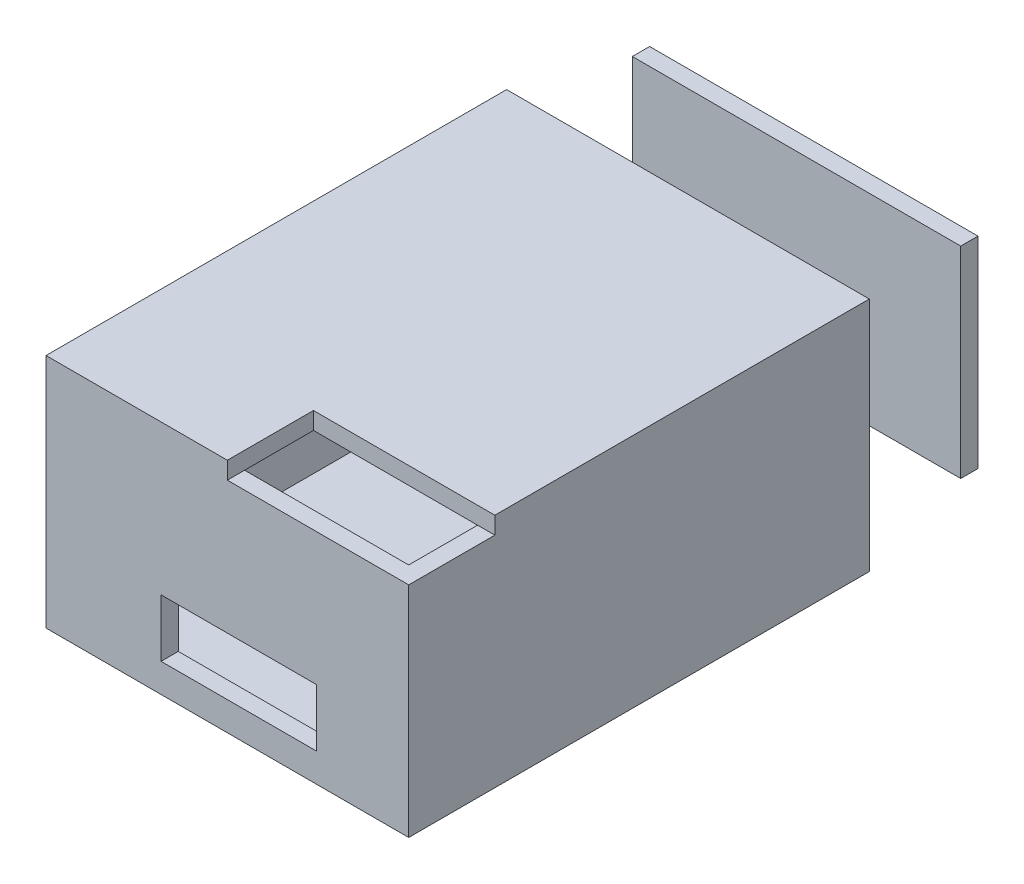
ISO-10303-21;
HEADER;
FILE_DESCRIPTION(('STEP AP214'),'2;1');
FILE_NAME('part.step','',(''),(''),'','','');
FILE_SCHEMA(('AUTOMOTIVE_DESIGN { 1 0 10303 214 1 1 1 1 }'));
ENDSEC;
DATA;
#1=APPLICATION_CONTEXT('core data for automotive mechanical design processes');
#2=APPLICATION_PROTOCOL_DEFINITION('international standard','automotive_design',2000,#1);
#3=PRODUCT_CONTEXT('',#1,'mechanical');
#4=PRODUCT('Part','Part','',(#3));
#5=PRODUCT_RELATED_PRODUCT_CATEGORY('part','',(#4));
#6=PRODUCT_DEFINITION_FORMATION('','',#4);
#7=PRODUCT_DEFINITION_CONTEXT('part definition',#1,'design');
#8=PRODUCT_DEFINITION('design','',#6,#7);
#9=PRODUCT_DEFINITION_SHAPE('','',#8);
#10=(LENGTH_UNIT() NAMED_UNIT(*) SI_UNIT(.MILLI.,.METRE.));
#11=(NAMED_UNIT(*) PLANE_ANGLE_UNIT() SI_UNIT($,.RADIAN.));
#12=(NAMED_UNIT(*) SI_UNIT($,.STERADIAN.) SOLID_ANGLE_UNIT());
#13=UNCERTAINTY_MEASURE_WITH_UNIT(LENGTH_MEASURE(1.E-05),#10,'distance_accuracy_value','');
#14=(GEOMETRIC_REPRESENTATION_CONTEXT(3) GLOBAL_UNCERTAINTY_ASSIGNED_CONTEXT((#13)) GLOBAL_UNIT_ASSIGNED_CONTEXT((#10,
#11,#12)) REPRESENTATION_CONTEXT('',''));
#15=CARTESIAN_POINT('',(0.,0.,0.));
#16=DIRECTION('',(0.,0.,1.));
#17=DIRECTION('',(1.,0.,0.));
#18=AXIS2_PLACEMENT_3D('',#15,#16,#17);
#19=CARTESIAN_POINT('',(1.83640845354915,36.8983163967638,-23.));
#20=DIRECTION('',(0.,-1.,0.));
#21=DIRECTION('',(0.,0.,-1.));
#22=AXIS2_PLACEMENT_3D('',#19,#20,#21);
#23=PLANE('',#22);
#24=DIRECTION('',(1.,0.,0.));
#25=VECTOR('',#24,1.);
#26=CARTESIAN_POINT('',(1.83640845354915,36.8983163967638,-20.));
#27=LINE('',#26,#25);
#28=CARTESIAN_POINT('',(1.83640845354915,36.8983163967638,-20.));
#29=VERTEX_POINT('',#28);
#30=CARTESIAN_POINT('',(58.8750360024886,36.8983163967638,-20.));
#31=VERTEX_POINT('',#30);
#32=EDGE_CURVE('E111',#29,#31,#27,.T.);
#33=ORIENTED_EDGE('',*,*,#32,.T.);
#34=DIRECTION('',(0.,0.,1.));
#35=VECTOR('',#34,1.);
#36=CARTESIAN_POINT('',(58.8750360024886,36.8983163967638,-23.));
#37=LINE('',#36,#35);
#38=CARTESIAN_POINT('',(58.8750360024886,36.8983163967638,-23.));
#39=VERTEX_POINT('',#38);
#40=EDGE_CURVE('E12',#39,#31,#37,.T.);
#41=ORIENTED_EDGE('',*,*,#40,.F.);
#42=DIRECTION('',(1.,0.,0.));
#43=VECTOR('',#42,1.);
#44=CARTESIAN_POINT('',(1.83640845354915,36.8983163967638,-23.));
#45=LINE('',#44,#43);
#46=CARTESIAN_POINT('',(1.83640845354915,36.8983163967638,-23.));
#47=VERTEX_POINT('',#46);
#48=EDGE_CURVE('E99',#47,#39,#45,.T.);
#49=ORIENTED_EDGE('',*,*,#48,.F.);
#50=DIRECTION('',(0.,0.,1.));
#51=VECTOR('',#50,1.);
#52=CARTESIAN_POINT('',(1.83640845354915,36.8983163967638,-23.));
#53=LINE('',#52,#51);
#54=EDGE_CURVE('E107',#47,#29,#53,.T.);
#55=ORIENTED_EDGE('',*,*,#54,.T.);
#56=EDGE_LOOP('',(#33,#41,#49,#55));
#57=FACE_BOUND('',#56,.T.);
#58=ADVANCED_FACE('F48',(#57),#23,.F.);
#59=CARTESIAN_POINT('',(58.8750360024886,36.8983163967638,-23.));
#60=DIRECTION('',(-1.,0.,0.));
#61=DIRECTION('',(0.,0.,1.));
#62=AXIS2_PLACEMENT_3D('',#59,#60,#61);
#63=PLANE('',#62);
#64=DIRECTION('',(0.,-1.,0.));
#65=VECTOR('',#64,1.);
#66=CARTESIAN_POINT('',(58.8750360024886,36.8983163967638,-20.));
#67=LINE('',#66,#65);
#68=CARTESIAN_POINT('',(58.8750360024886,1.9307687903769,-20.));
#69=VERTEX_POINT('',#68);
#70=EDGE_CURVE('E103',#31,#69,#67,.T.);
#71=ORIENTED_EDGE('',*,*,#70,.T.);
#72=DIRECTION('',(0.,0.,1.));
#73=VECTOR('',#72,1.);
#74=CARTESIAN_POINT('',(58.8750360024886,1.9307687903769,-23.));
#75=LINE('',#74,#73);
#76=CARTESIAN_POINT('',(58.8750360024886,1.9307687903769,-23.));
#77=VERTEX_POINT('',#76);
#78=EDGE_CURVE('E56',#77,#69,#75,.T.);
#79=ORIENTED_EDGE('',*,*,#78,.F.);
#80=DIRECTION('',(0.,-1.,0.));
#81=VECTOR('',#80,1.);
#82=CARTESIAN_POINT('',(58.8750360024886,36.8983163967638,-23.));
#83=LINE('',#82,#81);
#84=EDGE_CURVE('E94',#39,#77,#83,.T.);
#85=ORIENTED_EDGE('',*,*,#84,.F.);
#86=ORIENTED_EDGE('',*,*,#40,.T.);
#87=EDGE_LOOP('',(#71,#79,#85,#86));
#88=FACE_BOUND('',#87,.T.);
#89=ADVANCED_FACE('F102',(#88),#63,.F.);
#90=CARTESIAN_POINT('',(58.8750360024886,1.9307687903769,-23.));
#91=DIRECTION('',(0.,1.,0.));
#92=DIRECTION('',(0.,0.,1.));
#93=AXIS2_PLACEMENT_3D('',#90,#91,#92);
#94=PLANE('',#93);
#95=DIRECTION('',(-1.,0.,0.));
#96=VECTOR('',#95,1.);
#97=CARTESIAN_POINT('',(58.8750360024886,1.9307687903769,-20.));
#98=LINE('',#97,#96);
#99=CARTESIAN_POINT('',(1.83640845354915,1.9307687903769,-20.));
#100=VERTEX_POINT('',#99);
#101=EDGE_CURVE('E81',#69,#100,#98,.T.);
#102=ORIENTED_EDGE('',*,*,#101,.T.);
#103=DIRECTION('',(0.,0.,1.));
#104=VECTOR('',#103,1.);
#105=CARTESIAN_POINT('',(1.83640845354915,1.9307687903769,-23.));
#106=LINE('',#105,#104);
#107=CARTESIAN_POINT('',(1.83640845354915,1.9307687903769,-23.));
#108=VERTEX_POINT('',#107);
#109=EDGE_CURVE('E104',#108,#100,#106,.T.);
#110=ORIENTED_EDGE('',*,*,#109,.F.);
#111=DIRECTION('',(-1.,0.,0.));
#112=VECTOR('',#111,1.);
#113=CARTESIAN_POINT('',(58.8750360024886,1.9307687903769,-23.));
#114=LINE('',#113,#112);
#115=EDGE_CURVE('E97',#77,#108,#114,.T.);
#116=ORIENTED_EDGE('',*,*,#115,.F.);
#117=ORIENTED_EDGE('',*,*,#78,.T.);
#118=EDGE_LOOP('',(#102,#110,#116,#117));
#119=FACE_BOUND('',#118,.T.);
#120=ADVANCED_FACE('F105',(#119),#94,.F.);
#121=CARTESIAN_POINT('',(1.83640845354915,1.9307687903769,-23.));
#122=DIRECTION('',(1.,0.,0.));
#123=DIRECTION('',(0.,0.,-1.));
#124=AXIS2_PLACEMENT_3D('',#121,#122,#123);
#125=PLANE('',#124);
#126=DIRECTION('',(0.,1.,0.));
#127=VECTOR('',#126,1.);
#128=CARTESIAN_POINT('',(1.83640845354915,1.9307687903769,-20.));
#129=LINE('',#128,#127);
#130=EDGE_CURVE('E87',#100,#29,#129,.T.);
#131=ORIENTED_EDGE('',*,*,#130,.T.);
#132=ORIENTED_EDGE('',*,*,#54,.F.);
#133=DIRECTION('',(0.,1.,0.));
#134=VECTOR('',#133,1.);
#135=CARTESIAN_POINT('',(1.83640845354915,1.9307687903769,-23.));
#136=LINE('',#135,#134);
#137=EDGE_CURVE('E64',#108,#47,#136,.T.);
#138=ORIENTED_EDGE('',*,*,#137,.F.);
#139=ORIENTED_EDGE('',*,*,#109,.T.);
#140=EDGE_LOOP('',(#131,#132,#138,#139));
#141=FACE_BOUND('',#140,.T.);
#142=ADVANCED_FACE('F118',(#141),#125,.F.);
#143=CARTESIAN_POINT('',(0.,0.,-23.));
#144=DIRECTION('',(0.,0.,-1.));
#145=DIRECTION('',(-1.,0.,0.));
#146=AXIS2_PLACEMENT_3D('',#143,#144,#145);
#147=PLANE('',#146);
#148=ORIENTED_EDGE('',*,*,#48,.T.);
#149=ORIENTED_EDGE('',*,*,#84,.T.);
#150=ORIENTED_EDGE('',*,*,#115,.T.);
#151=ORIENTED_EDGE('',*,*,#137,.T.);
#152=EDGE_LOOP('',(#148,#149,#150,#151));
#153=FACE_BOUND('',#152,.T.);
#154=ADVANCED_FACE('F95',(#153),#147,.T.);
#155=CARTESIAN_POINT('',(0.,0.,-20.));
#156=DIRECTION('',(0.,0.,-1.));
#157=DIRECTION('',(-1.,0.,0.));
#158=AXIS2_PLACEMENT_3D('',#155,#156,#157);
#159=PLANE('',#158);
#160=ORIENTED_EDGE('',*,*,#32,.F.);
#161=ORIENTED_EDGE('',*,*,#130,.F.);
#162=ORIENTED_EDGE('',*,*,#101,.F.);
#163=ORIENTED_EDGE('',*,*,#70,.F.);
#164=EDGE_LOOP('',(#160,#161,#162,#163));
#165=FACE_BOUND('',#164,.T.);
#166=ADVANCED_FACE('F121',(#165),#159,.F.);
#167=CLOSED_SHELL('',(#58,#89,#120,#142,#154,#166));
#168=MANIFOLD_SOLID_BREP('B2',#167);
#169=CARTESIAN_POINT('',(0.,38.,0.));
#170=DIRECTION('',(0.,1.,0.));
#171=DIRECTION('',(0.,0.,1.));
#172=AXIS2_PLACEMENT_3D('',#169,#170,#171);
#173=PLANE('',#172);
#174=DIRECTION('',(-1.,0.,0.));
#175=VECTOR('',#174,1.);
#176=CARTESIAN_POINT('',(60.0017062927378,38.,77.0105584615521));
#177=LINE('',#176,#175);
#178=CARTESIAN_POINT('',(60.0017062927378,38.,77.0105584615521));
#179=VERTEX_POINT('',#178);
#180=CARTESIAN_POINT('',(31.4992071128971,38.,77.0105584615521));
#181=VERTEX_POINT('',#180);
#182=EDGE_CURVE('E384',#179,#181,#177,.T.);
#183=ORIENTED_EDGE('',*,*,#182,.T.);
#184=DIRECTION('',(-0.000265229162297402,0.,-0.999999964826745));
#185=VECTOR('',#184,1.);
#186=CARTESIAN_POINT('',(31.5,38.,80.));
#187=LINE('',#186,#185);
#188=CARTESIAN_POINT('',(31.5,38.,80.));
#189=VERTEX_POINT('',#188);
#190=EDGE_CURVE('E325',#189,#181,#187,.T.);
#191=ORIENTED_EDGE('',*,*,#190,.F.);
#192=DIRECTION('',(1.,0.,0.));
#193=VECTOR('',#192,1.);
#194=CARTESIAN_POINT('',(0.,38.,80.));
#195=LINE('',#194,#193);
#196=CARTESIAN_POINT('',(63.,38.,80.));
#197=VERTEX_POINT('',#196);
#198=EDGE_CURVE('E372',#189,#197,#195,.T.);
#199=ORIENTED_EDGE('',*,*,#198,.T.);
#200=DIRECTION('',(0.,0.,-1.));
#201=VECTOR('',#200,1.);
#202=CARTESIAN_POINT('',(63.,38.,80.));
#203=LINE('',#202,#201);
#204=CARTESIAN_POINT('',(63.,38.,65.0418472472438));
#205=VERTEX_POINT('',#204);
#206=EDGE_CURVE('E375',#197,#205,#203,.T.);
#207=ORIENTED_EDGE('',*,*,#206,.T.);
#208=DIRECTION('',(1.,0.,0.));
#209=VECTOR('',#208,1.);
#210=CARTESIAN_POINT('',(63.,38.,65.0418472472438));
#211=LINE('',#210,#209);
#212=CARTESIAN_POINT('',(60.0017062927378,38.,65.0418472472438));
#213=VERTEX_POINT('',#212);
#214=EDGE_CURVE('E367',#213,#205,#211,.T.);
#215=ORIENTED_EDGE('',*,*,#214,.F.);
#216=DIRECTION('',(0.,0.,1.));
#217=VECTOR('',#216,1.);
#218=CARTESIAN_POINT('',(60.0017062927378,38.,0.));
#219=LINE('',#218,#217);
#220=EDGE_CURVE('E379',#213,#179,#219,.T.);
#221=ORIENTED_EDGE('',*,*,#220,.T.);
#222=EDGE_LOOP('',(#183,#191,#199,#207,#215,#221));
#223=FACE_BOUND('',#222,.T.);
#224=ADVANCED_FACE('F171',(#223),#173,.T.);
#225=CARTESIAN_POINT('',(63.,41.,65.0418472472438));
#226=DIRECTION('',(0.,0.,-1.));
#227=DIRECTION('',(-1.,0.,0.));
#228=AXIS2_PLACEMENT_3D('',#225,#226,#227);
#229=PLANE('',#228);
#230=DIRECTION('',(0.,-1.,0.));
#231=VECTOR('',#230,1.);
#232=CARTESIAN_POINT('',(31.4960326615363,41.,65.0418472472438));
#233=LINE('',#232,#231);
#234=CARTESIAN_POINT('',(31.4960326615363,41.,65.0418472472438));
#235=VERTEX_POINT('',#234);
#236=CARTESIAN_POINT('',(31.4960326615363,38.,65.0418472472438));
#237=VERTEX_POINT('',#236);
#238=EDGE_CURVE('E329',#235,#237,#233,.T.);
#239=ORIENTED_EDGE('',*,*,#238,.T.);
#240=EDGE_CURVE('E350',#237,#213,#211,.T.);
#241=ORIENTED_EDGE('',*,*,#240,.T.);
#242=ORIENTED_EDGE('',*,*,#214,.T.);
#243=DIRECTION('',(0.,-1.,0.));
#244=VECTOR('',#243,1.);
#245=CARTESIAN_POINT('',(63.,41.,65.0418472472438));
#246=LINE('',#245,#244);
#247=CARTESIAN_POINT('',(63.,41.,65.0418472472438));
#248=VERTEX_POINT('',#247);
#249=EDGE_CURVE('E361',#248,#205,#246,.T.);
#250=ORIENTED_EDGE('',*,*,#249,.F.);
#251=DIRECTION('',(1.,0.,0.));
#252=VECTOR('',#251,1.);
#253=CARTESIAN_POINT('',(63.,41.,65.0418472472438));
#254=LINE('',#253,#252);
#255=EDGE_CURVE('E354',#235,#248,#254,.T.);
#256=ORIENTED_EDGE('',*,*,#255,.F.);
#257=EDGE_LOOP('',(#239,#241,#242,#250,#256));
#258=FACE_BOUND('',#257,.T.);
#259=ADVANCED_FACE('F475',(#258),#229,.F.);
#260=CARTESIAN_POINT('',(0.,3.,0.));
#261=DIRECTION('',(0.,-1.,0.));
#262=DIRECTION('',(0.,0.,-1.));
#263=AXIS2_PLACEMENT_3D('',#260,#261,#262);
#264=PLANE('',#263);
#265=DIRECTION('',(0.,0.,-1.));
#266=VECTOR('',#265,1.);
#267=CARTESIAN_POINT('',(2.99035903033484,3.,77.0105584615521));
#268=LINE('',#267,#266);
#269=CARTESIAN_POINT('',(2.99035903033484,3.,77.0105584615521));
#270=VERTEX_POINT('',#269);
#271=CARTESIAN_POINT('',(2.99035903033484,3.,0.));
#272=VERTEX_POINT('',#271);
#273=EDGE_CURVE('E376',#270,#272,#268,.T.);
#274=ORIENTED_EDGE('',*,*,#273,.F.);
#275=DIRECTION('',(-1.,0.,0.));
#276=VECTOR('',#275,1.);
#277=CARTESIAN_POINT('',(60.0017062927378,3.,77.0105584615521));
#278=LINE('',#277,#276);
#279=CARTESIAN_POINT('',(60.0017062927378,3.,77.0105584615521));
#280=VERTEX_POINT('',#279);
#281=EDGE_CURVE('E395',#280,#270,#278,.T.);
#282=ORIENTED_EDGE('',*,*,#281,.F.);
#283=DIRECTION('',(0.,0.,1.));
#284=VECTOR('',#283,1.);
#285=CARTESIAN_POINT('',(60.0017062927378,3.,0.));
#286=LINE('',#285,#284);
#287=CARTESIAN_POINT('',(60.0017062927378,3.,0.));
#288=VERTEX_POINT('',#287);
#289=EDGE_CURVE('E371',#288,#280,#286,.T.);
#290=ORIENTED_EDGE('',*,*,#289,.F.);
#291=DIRECTION('',(-1.,0.,0.));
#292=VECTOR('',#291,1.);
#293=CARTESIAN_POINT('',(0.,3.,0.));
#294=LINE('',#293,#292);
#295=EDGE_CURVE('E418',#288,#272,#294,.T.);
#296=ORIENTED_EDGE('',*,*,#295,.T.);
#297=EDGE_LOOP('',(#274,#282,#290,#296));
#298=FACE_BOUND('',#297,.T.);
#299=ADVANCED_FACE('F481',(#298),#264,.F.);
#300=CARTESIAN_POINT('',(0.,3.,80.));
#301=DIRECTION('',(1.,0.,0.));
#302=DIRECTION('',(0.,0.,-1.));
#303=AXIS2_PLACEMENT_3D('',#300,#301,#302);
#304=PLANE('',#303);
#305=DIRECTION('',(0.,-1.,0.));
#306=VECTOR('',#305,1.);
#307=CARTESIAN_POINT('',(0.,3.,80.));
#308=LINE('',#307,#306);
#309=CARTESIAN_POINT('',(0.,41.,80.));
#310=VERTEX_POINT('',#309);
#311=CARTESIAN_POINT('',(0.,0.,80.));
#312=VERTEX_POINT('',#311);
#313=EDGE_CURVE('E445',#310,#312,#308,.T.);
#314=ORIENTED_EDGE('',*,*,#313,.F.);
#315=DIRECTION('',(0.,0.,1.));
#316=VECTOR('',#315,1.);
#317=CARTESIAN_POINT('',(0.,41.,65.0418472472438));
#318=LINE('',#317,#316);
#319=CARTESIAN_POINT('',(0.,41.,0.));
#320=VERTEX_POINT('',#319);
#321=EDGE_CURVE('E349',#320,#310,#318,.T.);
#322=ORIENTED_EDGE('',*,*,#321,.F.);
#323=DIRECTION('',(0.,-1.,0.));
#324=VECTOR('',#323,1.);
#325=CARTESIAN_POINT('',(0.,3.,0.));
#326=LINE('',#325,#324);
#327=CARTESIAN_POINT('',(0.,0.,0.));
#328=VERTEX_POINT('',#327);
#329=EDGE_CURVE('E421',#320,#328,#326,.T.);
#330=ORIENTED_EDGE('',*,*,#329,.T.);
#331=DIRECTION('',(0.,0.,1.));
#332=VECTOR('',#331,1.);
#333=CARTESIAN_POINT('',(0.,0.,80.));
#334=LINE('',#333,#332);
#335=EDGE_CURVE('E417',#328,#312,#334,.T.);
#336=ORIENTED_EDGE('',*,*,#335,.T.);
#337=EDGE_LOOP('',(#314,#322,#330,#336));
#338=FACE_BOUND('',#337,.T.);
#339=ADVANCED_FACE('F173',(#338),#304,.F.);
#340=CARTESIAN_POINT('',(63.,3.,80.));
#341=DIRECTION('',(0.,0.,-1.));
#342=DIRECTION('',(-1.,0.,0.));
#343=AXIS2_PLACEMENT_3D('',#340,#341,#342);
#344=PLANE('',#343);
#345=DIRECTION('',(1.,0.,0.));
#346=VECTOR('',#345,1.);
#347=CARTESIAN_POINT('',(19.9831470628278,4.99078763607437,80.));
#348=LINE('',#347,#346);
#349=CARTESIAN_POINT('',(19.9831470628278,4.99078763607437,80.));
#350=VERTEX_POINT('',#349);
#351=CARTESIAN_POINT('',(46.980838103655,4.99078763607437,80.));
#352=VERTEX_POINT('',#351);
#353=EDGE_CURVE('E298',#350,#352,#348,.T.);
#354=ORIENTED_EDGE('',*,*,#353,.F.);
#355=DIRECTION('',(0.,-1.,0.));
#356=VECTOR('',#355,1.);
#357=CARTESIAN_POINT('',(19.9831470628278,14.993751347389,80.));
#358=LINE('',#357,#356);
#359=CARTESIAN_POINT('',(19.9831470628278,14.993751347389,80.));
#360=VERTEX_POINT('',#359);
#361=EDGE_CURVE('E187',#360,#350,#358,.T.);
#362=ORIENTED_EDGE('',*,*,#361,.F.);
#363=DIRECTION('',(-1.,0.,0.));
#364=VECTOR('',#363,1.);
#365=CARTESIAN_POINT('',(46.980838103655,14.993751347389,80.));
#366=LINE('',#365,#364);
#367=CARTESIAN_POINT('',(46.980838103655,14.993751347389,80.));
#368=VERTEX_POINT('',#367);
#369=EDGE_CURVE('E306',#368,#360,#366,.T.);
#370=ORIENTED_EDGE('',*,*,#369,.F.);
#371=DIRECTION('',(0.,1.,0.));
#372=VECTOR('',#371,1.);
#373=CARTESIAN_POINT('',(46.980838103655,4.99078763607437,80.));
#374=LINE('',#373,#372);
#375=EDGE_CURVE('E288',#352,#368,#374,.T.);
#376=ORIENTED_EDGE('',*,*,#375,.F.);
#377=EDGE_LOOP('',(#354,#362,#370,#376));
#378=FACE_BOUND('',#377,.T.);
#379=DIRECTION('',(1.,0.,0.));
#380=VECTOR('',#379,1.);
#381=CARTESIAN_POINT('',(63.,0.,80.));
#382=LINE('',#381,#380);
#383=CARTESIAN_POINT('',(63.,0.,80.));
#384=VERTEX_POINT('',#383);
#385=EDGE_CURVE('E426',#312,#384,#382,.T.);
#386=ORIENTED_EDGE('',*,*,#385,.T.);
#387=DIRECTION('',(0.,-1.,0.));
#388=VECTOR('',#387,1.);
#389=CARTESIAN_POINT('',(63.,3.,80.));
#390=LINE('',#389,#388);
#391=EDGE_CURVE('E441',#197,#384,#390,.T.);
#392=ORIENTED_EDGE('',*,*,#391,.F.);
#393=ORIENTED_EDGE('',*,*,#198,.F.);
#394=DIRECTION('',(0.,-1.,0.));
#395=VECTOR('',#394,1.);
#396=CARTESIAN_POINT('',(31.5,41.,80.));
#397=LINE('',#396,#395);
#398=CARTESIAN_POINT('',(31.5,41.,80.));
#399=VERTEX_POINT('',#398);
#400=EDGE_CURVE('E336',#399,#189,#397,.T.);
#401=ORIENTED_EDGE('',*,*,#400,.F.);
#402=DIRECTION('',(1.,0.,0.));
#403=VECTOR('',#402,1.);
#404=CARTESIAN_POINT('',(0.,41.,80.));
#405=LINE('',#404,#403);
#406=EDGE_CURVE('E321',#310,#399,#405,.T.);
#407=ORIENTED_EDGE('',*,*,#406,.F.);
#408=ORIENTED_EDGE('',*,*,#313,.T.);
#409=EDGE_LOOP('',(#386,#392,#393,#401,#407,#408));
#410=FACE_BOUND('',#409,.T.);
#411=ADVANCED_FACE('F303',(#378,#410),#344,.F.);
#412=CARTESIAN_POINT('',(63.,3.,0.));
#413=DIRECTION('',(-1.,0.,0.));
#414=DIRECTION('',(0.,0.,1.));
#415=AXIS2_PLACEMENT_3D('',#412,#413,#414);
#416=PLANE('',#415);
#417=DIRECTION('',(0.,0.,-1.));
#418=VECTOR('',#417,1.);
#419=CARTESIAN_POINT('',(63.,0.,0.));
#420=LINE('',#419,#418);
#421=CARTESIAN_POINT('',(63.,0.,0.));
#422=VERTEX_POINT('',#421);
#423=EDGE_CURVE('E429',#384,#422,#420,.T.);
#424=ORIENTED_EDGE('',*,*,#423,.T.);
#425=DIRECTION('',(0.,-1.,0.));
#426=VECTOR('',#425,1.);
#427=CARTESIAN_POINT('',(63.,3.,0.));
#428=LINE('',#427,#426);
#429=CARTESIAN_POINT('',(63.,41.,0.));
#430=VERTEX_POINT('',#429);
#431=EDGE_CURVE('E437',#430,#422,#428,.T.);
#432=ORIENTED_EDGE('',*,*,#431,.F.);
#433=DIRECTION('',(0.,0.,-1.));
#434=VECTOR('',#433,1.);
#435=CARTESIAN_POINT('',(63.,41.,0.));
#436=LINE('',#435,#434);
#437=EDGE_CURVE('E357',#248,#430,#436,.T.);
#438=ORIENTED_EDGE('',*,*,#437,.F.);
#439=ORIENTED_EDGE('',*,*,#249,.T.);
#440=ORIENTED_EDGE('',*,*,#206,.F.);
#441=ORIENTED_EDGE('',*,*,#391,.T.);
#442=EDGE_LOOP('',(#424,#432,#438,#439,#440,#441));
#443=FACE_BOUND('',#442,.T.);
#444=ADVANCED_FACE('F507',(#443),#416,.F.);
#445=CARTESIAN_POINT('',(0.,3.,0.));
#446=DIRECTION('',(0.,0.,1.));
#447=DIRECTION('',(1.,0.,0.));
#448=AXIS2_PLACEMENT_3D('',#445,#446,#447);
#449=PLANE('',#448);
#450=DIRECTION('',(0.,-1.,0.));
#451=VECTOR('',#450,1.);
#452=CARTESIAN_POINT('',(60.0017062927378,38.,0.));
#453=LINE('',#452,#451);
#454=CARTESIAN_POINT('',(60.0017062927378,38.,0.));
#455=VERTEX_POINT('',#454);
#456=EDGE_CURVE('E413',#455,#288,#453,.T.);
#457=ORIENTED_EDGE('',*,*,#456,.F.);
#458=DIRECTION('',(-1.,0.,0.));
#459=VECTOR('',#458,1.);
#460=CARTESIAN_POINT('',(0.,38.,0.));
#461=LINE('',#460,#459);
#462=CARTESIAN_POINT('',(2.99035903033484,38.,0.));
#463=VERTEX_POINT('',#462);
#464=EDGE_CURVE('E344',#455,#463,#461,.T.);
#465=ORIENTED_EDGE('',*,*,#464,.T.);
#466=DIRECTION('',(0.,-1.,0.));
#467=VECTOR('',#466,1.);
#468=CARTESIAN_POINT('',(2.99035903033484,38.,0.));
#469=LINE('',#468,#467);
#470=EDGE_CURVE('E391',#463,#272,#469,.T.);
#471=ORIENTED_EDGE('',*,*,#470,.T.);
#472=ORIENTED_EDGE('',*,*,#295,.F.);
#473=EDGE_LOOP('',(#457,#465,#471,#472));
#474=FACE_BOUND('',#473,.T.);
#475=DIRECTION('',(-1.,0.,0.));
#476=VECTOR('',#475,1.);
#477=CARTESIAN_POINT('',(0.,0.,0.));
#478=LINE('',#477,#476);
#479=EDGE_CURVE('E422',#422,#328,#478,.T.);
#480=ORIENTED_EDGE('',*,*,#479,.T.);
#481=ORIENTED_EDGE('',*,*,#329,.F.);
#482=DIRECTION('',(-1.,0.,0.));
#483=VECTOR('',#482,1.);
#484=CARTESIAN_POINT('',(0.,41.,0.));
#485=LINE('',#484,#483);
#486=EDGE_CURVE('E345',#430,#320,#485,.T.);
#487=ORIENTED_EDGE('',*,*,#486,.F.);
#488=ORIENTED_EDGE('',*,*,#431,.T.);
#489=EDGE_LOOP('',(#480,#481,#487,#488));
#490=FACE_BOUND('',#489,.T.);
#491=ADVANCED_FACE('F503',(#474,#490),#449,.F.);
#492=CARTESIAN_POINT('',(0.,0.,0.));
#493=DIRECTION('',(0.,-1.,0.));
#494=DIRECTION('',(0.,0.,-1.));
#495=AXIS2_PLACEMENT_3D('',#492,#493,#494);
#496=PLANE('',#495);
#497=ORIENTED_EDGE('',*,*,#335,.F.);
#498=ORIENTED_EDGE('',*,*,#479,.F.);
#499=ORIENTED_EDGE('',*,*,#423,.F.);
#500=ORIENTED_EDGE('',*,*,#385,.F.);
#501=EDGE_LOOP('',(#497,#498,#499,#500));
#502=FACE_BOUND('',#501,.T.);
#503=ADVANCED_FACE('F496',(#502),#496,.T.);
#504=CARTESIAN_POINT('',(60.0017062927378,38.,0.));
#505=DIRECTION('',(1.,0.,0.));
#506=DIRECTION('',(0.,0.,-1.));
#507=AXIS2_PLACEMENT_3D('',#504,#505,#506);
#508=PLANE('',#507);
#509=ORIENTED_EDGE('',*,*,#289,.T.);
#510=DIRECTION('',(0.,-1.,0.));
#511=VECTOR('',#510,1.);
#512=CARTESIAN_POINT('',(60.0017062927378,38.,77.0105584615521));
#513=LINE('',#512,#511);
#514=EDGE_CURVE('E409',#179,#280,#513,.T.);
#515=ORIENTED_EDGE('',*,*,#514,.F.);
#516=ORIENTED_EDGE('',*,*,#220,.F.);
#517=EDGE_CURVE('E380',#455,#213,#219,.T.);
#518=ORIENTED_EDGE('',*,*,#517,.F.);
#519=ORIENTED_EDGE('',*,*,#456,.T.);
#520=EDGE_LOOP('',(#509,#515,#516,#518,#519));
#521=FACE_BOUND('',#520,.T.);
#522=ADVANCED_FACE('F493',(#521),#508,.F.);
#523=CARTESIAN_POINT('',(60.0017062927378,38.,77.0105584615521));
#524=DIRECTION('',(0.,0.,1.));
#525=DIRECTION('',(1.,0.,0.));
#526=AXIS2_PLACEMENT_3D('',#523,#524,#525);
#527=PLANE('',#526);
#528=DIRECTION('',(-1.,0.,0.));
#529=VECTOR('',#528,1.);
#530=CARTESIAN_POINT('',(60.0017062927378,14.993751347389,77.0105584615521));
#531=LINE('',#530,#529);
#532=CARTESIAN_POINT('',(46.980838103655,14.993751347389,77.0105584615521));
#533=VERTEX_POINT('',#532);
#534=CARTESIAN_POINT('',(19.9831470628278,14.993751347389,77.0105584615521));
#535=VERTEX_POINT('',#534);
#536=EDGE_CURVE('E180',#533,#535,#531,.T.);
#537=ORIENTED_EDGE('',*,*,#536,.T.);
#538=DIRECTION('',(0.,-1.,0.));
#539=VECTOR('',#538,1.);
#540=CARTESIAN_POINT('',(19.9831470628278,38.,77.0105584615521));
#541=LINE('',#540,#539);
#542=CARTESIAN_POINT('',(19.9831470628278,4.99078763607437,77.0105584615521));
#543=VERTEX_POINT('',#542);
#544=EDGE_CURVE('E46',#535,#543,#541,.T.);
#545=ORIENTED_EDGE('',*,*,#544,.T.);
#546=DIRECTION('',(1.,0.,0.));
#547=VECTOR('',#546,1.);
#548=CARTESIAN_POINT('',(60.0017062927378,4.99078763607437,77.0105584615521));
#549=LINE('',#548,#547);
#550=CARTESIAN_POINT('',(46.980838103655,4.99078763607437,77.0105584615521));
#551=VERTEX_POINT('',#550);
#552=EDGE_CURVE('E449',#543,#551,#549,.T.);
#553=ORIENTED_EDGE('',*,*,#552,.T.);
#554=DIRECTION('',(0.,1.,0.));
#555=VECTOR('',#554,1.);
#556=CARTESIAN_POINT('',(46.980838103655,38.,77.0105584615521));
#557=LINE('',#556,#555);
#558=EDGE_CURVE('E291',#551,#533,#557,.T.);
#559=ORIENTED_EDGE('',*,*,#558,.T.);
#560=EDGE_LOOP('',(#537,#545,#553,#559));
#561=FACE_BOUND('',#560,.T.);
#562=ORIENTED_EDGE('',*,*,#281,.T.);
#563=DIRECTION('',(0.,-1.,0.));
#564=VECTOR('',#563,1.);
#565=CARTESIAN_POINT('',(2.99035903033484,38.,77.0105584615521));
#566=LINE('',#565,#564);
#567=CARTESIAN_POINT('',(2.99035903033484,38.,77.0105584615521));
#568=VERTEX_POINT('',#567);
#569=EDGE_CURVE('E405',#568,#270,#566,.T.);
#570=ORIENTED_EDGE('',*,*,#569,.F.);
#571=DIRECTION('',(-1.,0.,0.));
#572=VECTOR('',#571,1.);
#573=CARTESIAN_POINT('',(60.0017062927378,38.,77.0105584615521));
#574=LINE('',#573,#572);
#575=EDGE_CURVE('E340',#181,#568,#574,.T.);
#576=ORIENTED_EDGE('',*,*,#575,.F.);
#577=ORIENTED_EDGE('',*,*,#182,.F.);
#578=ORIENTED_EDGE('',*,*,#514,.T.);
#579=EDGE_LOOP('',(#562,#570,#576,#577,#578));
#580=FACE_BOUND('',#579,.T.);
#581=ADVANCED_FACE('F456',(#561,#580),#527,.F.);
#582=CARTESIAN_POINT('',(2.99035903033484,38.,77.0105584615521));
#583=DIRECTION('',(-1.,0.,0.));
#584=DIRECTION('',(0.,0.,1.));
#585=AXIS2_PLACEMENT_3D('',#582,#583,#584);
#586=PLANE('',#585);
#587=ORIENTED_EDGE('',*,*,#273,.T.);
#588=ORIENTED_EDGE('',*,*,#470,.F.);
#589=DIRECTION('',(0.,0.,-1.));
#590=VECTOR('',#589,1.);
#591=CARTESIAN_POINT('',(2.99035903033484,38.,77.0105584615521));
#592=LINE('',#591,#590);
#593=EDGE_CURVE('E388',#568,#463,#592,.T.);
#594=ORIENTED_EDGE('',*,*,#593,.F.);
#595=ORIENTED_EDGE('',*,*,#569,.T.);
#596=EDGE_LOOP('',(#587,#588,#594,#595));
#597=FACE_BOUND('',#596,.T.);
#598=ADVANCED_FACE('F486',(#597),#586,.F.);
#599=CARTESIAN_POINT('',(0.,41.,0.));
#600=DIRECTION('',(0.,-1.,0.));
#601=DIRECTION('',(0.,0.,-1.));
#602=AXIS2_PLACEMENT_3D('',#599,#600,#601);
#603=PLANE('',#602);
#604=ORIENTED_EDGE('',*,*,#486,.T.);
#605=ORIENTED_EDGE('',*,*,#321,.T.);
#606=ORIENTED_EDGE('',*,*,#406,.T.);
#607=DIRECTION('',(-0.000265229162297402,0.,-0.999999964826745));
#608=VECTOR('',#607,1.);
#609=CARTESIAN_POINT('',(31.5,41.,80.));
#610=LINE('',#609,#608);
#611=EDGE_CURVE('E324',#399,#235,#610,.T.);
#612=ORIENTED_EDGE('',*,*,#611,.T.);
#613=ORIENTED_EDGE('',*,*,#255,.T.);
#614=ORIENTED_EDGE('',*,*,#437,.T.);
#615=EDGE_LOOP('',(#604,#605,#606,#612,#613,#614));
#616=FACE_BOUND('',#615,.T.);
#617=ADVANCED_FACE('F489',(#616),#603,.F.);
#618=CARTESIAN_POINT('',(0.,38.,0.));
#619=DIRECTION('',(0.,-1.,0.));
#620=DIRECTION('',(0.,0.,-1.));
#621=AXIS2_PLACEMENT_3D('',#618,#619,#620);
#622=PLANE('',#621);
#623=ORIENTED_EDGE('',*,*,#464,.F.);
#624=ORIENTED_EDGE('',*,*,#517,.T.);
#625=ORIENTED_EDGE('',*,*,#240,.F.);
#626=EDGE_CURVE('E316',#181,#237,#187,.T.);
#627=ORIENTED_EDGE('',*,*,#626,.F.);
#628=ORIENTED_EDGE('',*,*,#575,.T.);
#629=ORIENTED_EDGE('',*,*,#593,.T.);
#630=EDGE_LOOP('',(#623,#624,#625,#627,#628,#629));
#631=FACE_BOUND('',#630,.T.);
#632=ADVANCED_FACE('F470',(#631),#622,.T.);
#633=CARTESIAN_POINT('',(31.5,41.,80.));
#634=DIRECTION('',(-0.999999964826745,0.,0.000265229162297402));
#635=DIRECTION('',(0.000265229162297402,0.,0.999999964826745));
#636=AXIS2_PLACEMENT_3D('',#633,#634,#635);
#637=PLANE('',#636);
#638=ORIENTED_EDGE('',*,*,#190,.T.);
#639=ORIENTED_EDGE('',*,*,#626,.T.);
#640=ORIENTED_EDGE('',*,*,#238,.F.);
#641=ORIENTED_EDGE('',*,*,#611,.F.);
#642=ORIENTED_EDGE('',*,*,#400,.T.);
#643=EDGE_LOOP('',(#638,#639,#640,#641,#642));
#644=FACE_BOUND('',#643,.T.);
#645=ADVANCED_FACE('F463',(#644),#637,.F.);
#646=CARTESIAN_POINT('',(19.9831470628278,14.993751347389,77.));
#647=DIRECTION('',(-1.,0.,0.));
#648=DIRECTION('',(0.,0.,1.));
#649=AXIS2_PLACEMENT_3D('',#646,#647,#648);
#650=PLANE('',#649);
#651=DIRECTION('',(0.,0.,1.));
#652=VECTOR('',#651,1.);
#653=CARTESIAN_POINT('',(19.9831470628278,14.993751347389,77.));
#654=LINE('',#653,#652);
#655=EDGE_CURVE('E313',#535,#360,#654,.T.);
#656=ORIENTED_EDGE('',*,*,#655,.T.);
#657=ORIENTED_EDGE('',*,*,#361,.T.);
#658=DIRECTION('',(0.,0.,1.));
#659=VECTOR('',#658,1.);
#660=CARTESIAN_POINT('',(19.9831470628278,4.99078763607437,77.));
#661=LINE('',#660,#659);
#662=EDGE_CURVE('E295',#543,#350,#661,.T.);
#663=ORIENTED_EDGE('',*,*,#662,.F.);
#664=ORIENTED_EDGE('',*,*,#544,.F.);
#665=EDGE_LOOP('',(#656,#657,#663,#664));
#666=FACE_BOUND('',#665,.T.);
#667=ADVANCED_FACE('F461',(#666),#650,.F.);
#668=CARTESIAN_POINT('',(46.980838103655,14.993751347389,77.));
#669=DIRECTION('',(0.,1.,0.));
#670=DIRECTION('',(0.,0.,1.));
#671=AXIS2_PLACEMENT_3D('',#668,#669,#670);
#672=PLANE('',#671);
#673=DIRECTION('',(0.,0.,1.));
#674=VECTOR('',#673,1.);
#675=CARTESIAN_POINT('',(46.980838103655,14.993751347389,77.));
#676=LINE('',#675,#674);
#677=EDGE_CURVE('E294',#533,#368,#676,.T.);
#678=ORIENTED_EDGE('',*,*,#677,.T.);
#679=ORIENTED_EDGE('',*,*,#369,.T.);
#680=ORIENTED_EDGE('',*,*,#655,.F.);
#681=ORIENTED_EDGE('',*,*,#536,.F.);
#682=EDGE_LOOP('',(#678,#679,#680,#681));
#683=FACE_BOUND('',#682,.T.);
#684=ADVANCED_FACE('F460',(#683),#672,.F.);
#685=CARTESIAN_POINT('',(46.980838103655,4.99078763607437,77.));
#686=DIRECTION('',(1.,0.,0.));
#687=DIRECTION('',(0.,0.,-1.));
#688=AXIS2_PLACEMENT_3D('',#685,#686,#687);
#689=PLANE('',#688);
#690=DIRECTION('',(0.,0.,1.));
#691=VECTOR('',#690,1.);
#692=CARTESIAN_POINT('',(46.980838103655,4.99078763607437,77.));
#693=LINE('',#692,#691);
#694=EDGE_CURVE('E195',#551,#352,#693,.T.);
#695=ORIENTED_EDGE('',*,*,#694,.T.);
#696=ORIENTED_EDGE('',*,*,#375,.T.);
#697=ORIENTED_EDGE('',*,*,#677,.F.);
#698=ORIENTED_EDGE('',*,*,#558,.F.);
#699=EDGE_LOOP('',(#695,#696,#697,#698));
#700=FACE_BOUND('',#699,.T.);
#701=ADVANCED_FACE('F285',(#700),#689,.F.);
#702=CARTESIAN_POINT('',(19.9831470628278,4.99078763607437,77.));
#703=DIRECTION('',(0.,-1.,0.));
#704=DIRECTION('',(0.,0.,-1.));
#705=AXIS2_PLACEMENT_3D('',#702,#703,#704);
#706=PLANE('',#705);
#707=ORIENTED_EDGE('',*,*,#662,.T.);
#708=ORIENTED_EDGE('',*,*,#353,.T.);
#709=ORIENTED_EDGE('',*,*,#694,.F.);
#710=ORIENTED_EDGE('',*,*,#552,.F.);
#711=EDGE_LOOP('',(#707,#708,#709,#710));
#712=FACE_BOUND('',#711,.T.);
#713=ADVANCED_FACE('F299',(#712),#706,.F.);
#714=CLOSED_SHELL('',(#224,#259,#299,#339,#411,#444,#491,#503,#522,#581,#598,#617,#632,#645,
#667,#684,#701,#713));
#715=MANIFOLD_SOLID_BREP('B6',#714);
#716=ADVANCED_BREP_SHAPE_REPRESENTATION('',(#18,#168,#715),#14);
#717=SHAPE_DEFINITION_REPRESENTATION(#9,#716);
ENDSEC;
END-ISO-10303-21;
